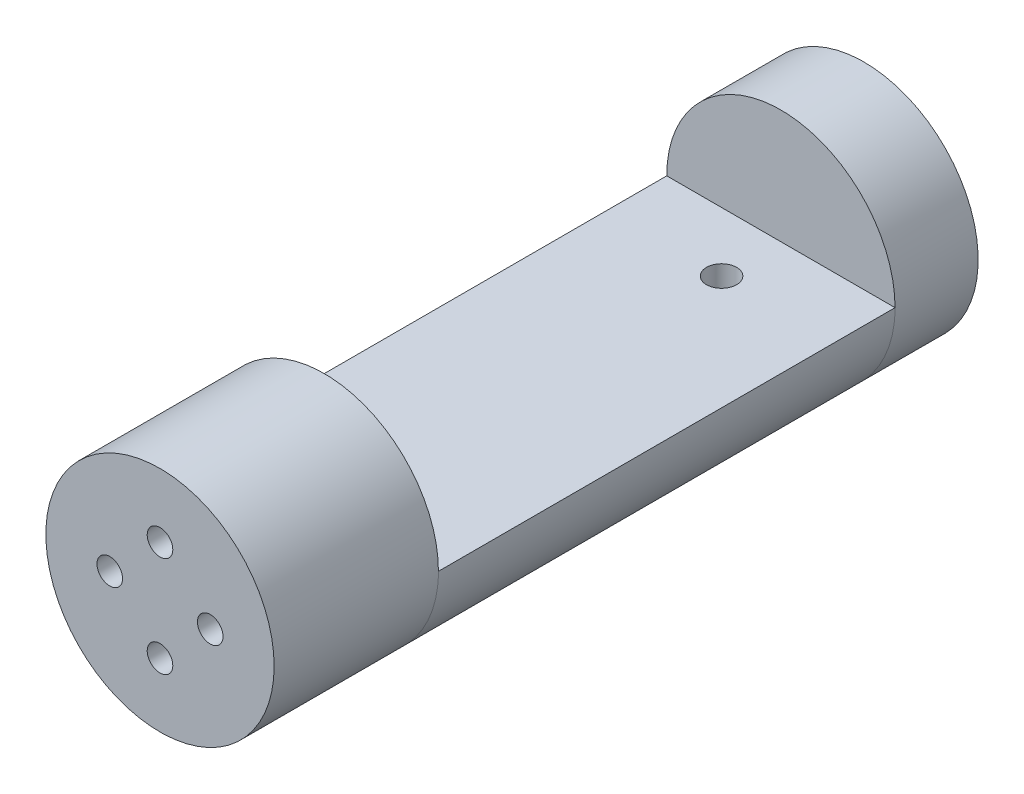
ISO-10303-21;
HEADER;
FILE_DESCRIPTION(('STEP AP214'),'2;1');
FILE_NAME('part.step','',(''),(''),'','','');
FILE_SCHEMA(('AUTOMOTIVE_DESIGN { 1 0 10303 214 1 1 1 1 }'));
ENDSEC;
DATA;
#1=APPLICATION_CONTEXT('core data for automotive mechanical design processes');
#2=APPLICATION_PROTOCOL_DEFINITION('international standard','automotive_design',2000,#1);
#3=PRODUCT_CONTEXT('',#1,'mechanical');
#4=PRODUCT('Part','Part','',(#3));
#5=PRODUCT_RELATED_PRODUCT_CATEGORY('part','',(#4));
#6=PRODUCT_DEFINITION_FORMATION('','',#4);
#7=PRODUCT_DEFINITION_CONTEXT('part definition',#1,'design');
#8=PRODUCT_DEFINITION('design','',#6,#7);
#9=PRODUCT_DEFINITION_SHAPE('','',#8);
#10=(LENGTH_UNIT() NAMED_UNIT(*) SI_UNIT(.MILLI.,.METRE.));
#11=(NAMED_UNIT(*) PLANE_ANGLE_UNIT() SI_UNIT($,.RADIAN.));
#12=(NAMED_UNIT(*) SI_UNIT($,.STERADIAN.) SOLID_ANGLE_UNIT());
#13=UNCERTAINTY_MEASURE_WITH_UNIT(LENGTH_MEASURE(1.E-05),#10,'distance_accuracy_value','');
#14=(GEOMETRIC_REPRESENTATION_CONTEXT(3) GLOBAL_UNCERTAINTY_ASSIGNED_CONTEXT((#13)) GLOBAL_UNIT_ASSIGNED_CONTEXT((#10,
#11,#12)) REPRESENTATION_CONTEXT('',''));
#15=CARTESIAN_POINT('',(0.,0.,0.));
#16=DIRECTION('',(0.,0.,1.));
#17=DIRECTION('',(1.,0.,0.));
#18=AXIS2_PLACEMENT_3D('',#15,#16,#17);
#19=CARTESIAN_POINT('',(0.,0.,17.99));
#20=DIRECTION('',(0.,0.,-1.));
#21=DIRECTION('',(-1.,0.,0.));
#22=AXIS2_PLACEMENT_3D('',#19,#20,#21);
#23=CYLINDRICAL_SURFACE('',#22,12.5);
#24=CARTESIAN_POINT('',(0.,0.,17.99));
#25=DIRECTION('',(0.,0.,1.));
#26=DIRECTION('',(1.,0.,0.));
#27=AXIS2_PLACEMENT_3D('',#24,#25,#26);
#28=CIRCLE('',#27,12.5);
#29=CARTESIAN_POINT('',(12.5,0.,17.99));
#30=VERTEX_POINT('',#29);
#31=EDGE_CURVE('E11',#30,#30,#28,.T.);
#32=ORIENTED_EDGE('',*,*,#31,.F.);
#33=EDGE_LOOP('',(#32));
#34=FACE_BOUND('',#33,.T.);
#35=CARTESIAN_POINT('',(0.,0.,0.));
#36=DIRECTION('',(0.,0.,1.));
#37=DIRECTION('',(1.,0.,0.));
#38=AXIS2_PLACEMENT_3D('',#35,#36,#37);
#39=CIRCLE('',#38,12.5);
#40=CARTESIAN_POINT('',(12.5,0.,0.));
#41=VERTEX_POINT('',#40);
#42=CARTESIAN_POINT('',(-12.5,0.,0.));
#43=VERTEX_POINT('',#42);
#44=EDGE_CURVE('E42',#41,#43,#39,.T.);
#45=ORIENTED_EDGE('',*,*,#44,.T.);
#46=CARTESIAN_POINT('',(0.,0.,0.));
#47=DIRECTION('',(0.,0.,1.));
#48=DIRECTION('',(1.,0.,0.));
#49=AXIS2_PLACEMENT_3D('',#46,#47,#48);
#50=ELLIPSE('',#49,12.5,12.5);
#51=EDGE_CURVE('E54',#43,#41,#50,.T.);
#52=ORIENTED_EDGE('',*,*,#51,.T.);
#53=EDGE_LOOP('',(#45,#52));
#54=FACE_BOUND('',#53,.T.);
#55=ADVANCED_FACE('F39',(#34,#54),#23,.T.);
#56=CARTESIAN_POINT('',(0.,0.,17.99));
#57=DIRECTION('',(0.,0.,1.));
#58=DIRECTION('',(1.,0.,0.));
#59=AXIS2_PLACEMENT_3D('',#56,#57,#58);
#60=PLANE('',#59);
#61=CARTESIAN_POINT('',(-5.5,0.,17.99));
#62=DIRECTION('',(0.,0.,1.));
#63=DIRECTION('',(1.,0.,0.));
#64=AXIS2_PLACEMENT_3D('',#61,#62,#63);
#65=CIRCLE('',#64,1.4);
#66=CARTESIAN_POINT('',(-4.1,0.,17.99));
#67=VERTEX_POINT('',#66);
#68=EDGE_CURVE('E158',#67,#67,#65,.T.);
#69=ORIENTED_EDGE('',*,*,#68,.F.);
#70=EDGE_LOOP('',(#69));
#71=FACE_BOUND('',#70,.T.);
#72=CARTESIAN_POINT('',(0.,5.5,17.99));
#73=DIRECTION('',(0.,0.,1.));
#74=DIRECTION('',(1.,0.,0.));
#75=AXIS2_PLACEMENT_3D('',#72,#73,#74);
#76=CIRCLE('',#75,1.4);
#77=CARTESIAN_POINT('',(1.4,5.5,17.99));
#78=VERTEX_POINT('',#77);
#79=EDGE_CURVE('E163',#78,#78,#76,.T.);
#80=ORIENTED_EDGE('',*,*,#79,.F.);
#81=EDGE_LOOP('',(#80));
#82=FACE_BOUND('',#81,.T.);
#83=CARTESIAN_POINT('',(5.5,0.,17.99));
#84=DIRECTION('',(0.,0.,1.));
#85=DIRECTION('',(1.,0.,0.));
#86=AXIS2_PLACEMENT_3D('',#83,#84,#85);
#87=CIRCLE('',#86,1.4);
#88=CARTESIAN_POINT('',(6.9,0.,17.99));
#89=VERTEX_POINT('',#88);
#90=EDGE_CURVE('E173',#89,#89,#87,.T.);
#91=ORIENTED_EDGE('',*,*,#90,.F.);
#92=EDGE_LOOP('',(#91));
#93=FACE_BOUND('',#92,.T.);
#94=CARTESIAN_POINT('',(0.,-5.5,17.99));
#95=DIRECTION('',(0.,0.,1.));
#96=DIRECTION('',(1.,0.,0.));
#97=AXIS2_PLACEMENT_3D('',#94,#95,#96);
#98=CIRCLE('',#97,1.4);
#99=CARTESIAN_POINT('',(1.4,-5.5,17.99));
#100=VERTEX_POINT('',#99);
#101=EDGE_CURVE('E181',#100,#100,#98,.T.);
#102=ORIENTED_EDGE('',*,*,#101,.F.);
#103=EDGE_LOOP('',(#102));
#104=FACE_BOUND('',#103,.T.);
#105=ORIENTED_EDGE('',*,*,#31,.T.);
#106=EDGE_LOOP('',(#105));
#107=FACE_BOUND('',#106,.T.);
#108=ADVANCED_FACE('F139',(#71,#82,#93,#104,#107),#60,.T.);
#109=CARTESIAN_POINT('',(0.,0.,0.));
#110=DIRECTION('',(0.,0.,1.));
#111=DIRECTION('',(1.,0.,0.));
#112=AXIS2_PLACEMENT_3D('',#109,#110,#111);
#113=PLANE('',#112);
#114=ORIENTED_EDGE('',*,*,#44,.F.);
#115=DIRECTION('',(-1.,0.,0.));
#116=VECTOR('',#115,1.);
#117=CARTESIAN_POINT('',(12.5,0.,0.));
#118=LINE('',#117,#116);
#119=EDGE_CURVE('E85',#41,#43,#118,.T.);
#120=ORIENTED_EDGE('',*,*,#119,.T.);
#121=EDGE_LOOP('',(#114,#120));
#122=FACE_BOUND('',#121,.T.);
#123=ADVANCED_FACE('F134',(#122),#113,.F.);
#124=CARTESIAN_POINT('',(0.,-5.5,9.99));
#125=DIRECTION('',(0.,0.,1.));
#126=DIRECTION('',(1.,0.,0.));
#127=AXIS2_PLACEMENT_3D('',#124,#125,#126);
#128=CYLINDRICAL_SURFACE('',#127,1.4);
#129=CARTESIAN_POINT('',(0.,-5.5,9.99));
#130=DIRECTION('',(0.,0.,1.));
#131=DIRECTION('',(1.,0.,0.));
#132=AXIS2_PLACEMENT_3D('',#129,#130,#131);
#133=CIRCLE('',#132,1.4);
#134=CARTESIAN_POINT('',(1.4,-5.5,9.99));
#135=VERTEX_POINT('',#134);
#136=EDGE_CURVE('E87',#135,#135,#133,.T.);
#137=ORIENTED_EDGE('',*,*,#136,.F.);
#138=EDGE_LOOP('',(#137));
#139=FACE_BOUND('',#138,.T.);
#140=ORIENTED_EDGE('',*,*,#101,.T.);
#141=EDGE_LOOP('',(#140));
#142=FACE_BOUND('',#141,.T.);
#143=ADVANCED_FACE('F131',(#139,#142),#128,.F.);
#144=CARTESIAN_POINT('',(0.,-5.5,9.99));
#145=DIRECTION('',(0.,0.,1.));
#146=DIRECTION('',(1.,0.,0.));
#147=AXIS2_PLACEMENT_3D('',#144,#145,#146);
#148=PLANE('',#147);
#149=ORIENTED_EDGE('',*,*,#136,.T.);
#150=EDGE_LOOP('',(#149));
#151=FACE_BOUND('',#150,.T.);
#152=ADVANCED_FACE('F126',(#151),#148,.T.);
#153=CARTESIAN_POINT('',(5.5,0.,9.99));
#154=DIRECTION('',(0.,0.,1.));
#155=DIRECTION('',(1.,0.,0.));
#156=AXIS2_PLACEMENT_3D('',#153,#154,#155);
#157=CYLINDRICAL_SURFACE('',#156,1.4);
#158=CARTESIAN_POINT('',(5.5,0.,9.99));
#159=DIRECTION('',(0.,0.,1.));
#160=DIRECTION('',(1.,0.,0.));
#161=AXIS2_PLACEMENT_3D('',#158,#159,#160);
#162=CIRCLE('',#161,1.4);
#163=CARTESIAN_POINT('',(6.9,0.,9.99));
#164=VERTEX_POINT('',#163);
#165=EDGE_CURVE('E177',#164,#164,#162,.T.);
#166=ORIENTED_EDGE('',*,*,#165,.F.);
#167=EDGE_LOOP('',(#166));
#168=FACE_BOUND('',#167,.T.);
#169=ORIENTED_EDGE('',*,*,#90,.T.);
#170=EDGE_LOOP('',(#169));
#171=FACE_BOUND('',#170,.T.);
#172=ADVANCED_FACE('F123',(#168,#171),#157,.F.);
#173=CARTESIAN_POINT('',(5.5,0.,9.99));
#174=DIRECTION('',(0.,0.,1.));
#175=DIRECTION('',(1.,0.,0.));
#176=AXIS2_PLACEMENT_3D('',#173,#174,#175);
#177=PLANE('',#176);
#178=ORIENTED_EDGE('',*,*,#165,.T.);
#179=EDGE_LOOP('',(#178));
#180=FACE_BOUND('',#179,.T.);
#181=ADVANCED_FACE('F118',(#180),#177,.T.);
#182=CARTESIAN_POINT('',(0.,5.5,9.99));
#183=DIRECTION('',(0.,0.,1.));
#184=DIRECTION('',(1.,0.,0.));
#185=AXIS2_PLACEMENT_3D('',#182,#183,#184);
#186=CYLINDRICAL_SURFACE('',#185,1.4);
#187=CARTESIAN_POINT('',(0.,5.5,9.99));
#188=DIRECTION('',(0.,0.,1.));
#189=DIRECTION('',(1.,0.,0.));
#190=AXIS2_PLACEMENT_3D('',#187,#188,#189);
#191=CIRCLE('',#190,1.4);
#192=CARTESIAN_POINT('',(1.4,5.5,9.99));
#193=VERTEX_POINT('',#192);
#194=EDGE_CURVE('E169',#193,#193,#191,.T.);
#195=ORIENTED_EDGE('',*,*,#194,.F.);
#196=EDGE_LOOP('',(#195));
#197=FACE_BOUND('',#196,.T.);
#198=ORIENTED_EDGE('',*,*,#79,.T.);
#199=EDGE_LOOP('',(#198));
#200=FACE_BOUND('',#199,.T.);
#201=ADVANCED_FACE('F115',(#197,#200),#186,.F.);
#202=CARTESIAN_POINT('',(0.,5.5,9.99));
#203=DIRECTION('',(0.,0.,1.));
#204=DIRECTION('',(1.,0.,0.));
#205=AXIS2_PLACEMENT_3D('',#202,#203,#204);
#206=PLANE('',#205);
#207=ORIENTED_EDGE('',*,*,#194,.T.);
#208=EDGE_LOOP('',(#207));
#209=FACE_BOUND('',#208,.T.);
#210=ADVANCED_FACE('F113',(#209),#206,.T.);
#211=CARTESIAN_POINT('',(-5.5,0.,9.99));
#212=DIRECTION('',(0.,0.,1.));
#213=DIRECTION('',(1.,0.,0.));
#214=AXIS2_PLACEMENT_3D('',#211,#212,#213);
#215=CYLINDRICAL_SURFACE('',#214,1.4);
#216=CARTESIAN_POINT('',(-5.5,0.,9.99));
#217=DIRECTION('',(0.,0.,1.));
#218=DIRECTION('',(1.,0.,0.));
#219=AXIS2_PLACEMENT_3D('',#216,#217,#218);
#220=CIRCLE('',#219,1.4);
#221=CARTESIAN_POINT('',(-4.1,0.,9.99));
#222=VERTEX_POINT('',#221);
#223=EDGE_CURVE('E155',#222,#222,#220,.T.);
#224=ORIENTED_EDGE('',*,*,#223,.F.);
#225=EDGE_LOOP('',(#224));
#226=FACE_BOUND('',#225,.T.);
#227=ORIENTED_EDGE('',*,*,#68,.T.);
#228=EDGE_LOOP('',(#227));
#229=FACE_BOUND('',#228,.T.);
#230=ADVANCED_FACE('F109',(#226,#229),#215,.F.);
#231=CARTESIAN_POINT('',(-5.5,0.,9.99));
#232=DIRECTION('',(0.,0.,1.));
#233=DIRECTION('',(1.,0.,0.));
#234=AXIS2_PLACEMENT_3D('',#231,#232,#233);
#235=PLANE('',#234);
#236=ORIENTED_EDGE('',*,*,#223,.T.);
#237=EDGE_LOOP('',(#236));
#238=FACE_BOUND('',#237,.T.);
#239=ADVANCED_FACE('F105',(#238),#235,.T.);
#240=CARTESIAN_POINT('',(12.5,0.,-50.));
#241=DIRECTION('',(0.,1.,0.));
#242=DIRECTION('',(0.,0.,1.));
#243=AXIS2_PLACEMENT_3D('',#240,#241,#242);
#244=PLANE('',#243);
#245=CARTESIAN_POINT('',(0.,0.,-43.5));
#246=DIRECTION('',(0.,1.,0.));
#247=DIRECTION('',(0.,0.,1.));
#248=AXIS2_PLACEMENT_3D('',#245,#246,#247);
#249=CIRCLE('',#248,1.65);
#250=CARTESIAN_POINT('',(0.,0.,-41.85));
#251=VERTEX_POINT('',#250);
#252=EDGE_CURVE('E216',#251,#251,#249,.T.);
#253=ORIENTED_EDGE('',*,*,#252,.F.);
#254=EDGE_LOOP('',(#253));
#255=FACE_BOUND('',#254,.T.);
#256=CARTESIAN_POINT('',(0.,0.,-6.50000000000001));
#257=DIRECTION('',(0.,1.,0.));
#258=DIRECTION('',(0.,0.,1.));
#259=AXIS2_PLACEMENT_3D('',#256,#257,#258);
#260=CIRCLE('',#259,1.65);
#261=CARTESIAN_POINT('',(0.,0.,-4.85));
#262=VERTEX_POINT('',#261);
#263=EDGE_CURVE('E208',#262,#262,#260,.T.);
#264=ORIENTED_EDGE('',*,*,#263,.F.);
#265=EDGE_LOOP('',(#264));
#266=FACE_BOUND('',#265,.T.);
#267=ORIENTED_EDGE('',*,*,#119,.F.);
#268=DIRECTION('',(0.,0.,1.));
#269=VECTOR('',#268,1.);
#270=CARTESIAN_POINT('',(12.5,0.,-50.));
#271=LINE('',#270,#269);
#272=CARTESIAN_POINT('',(12.5,0.,-50.));
#273=VERTEX_POINT('',#272);
#274=EDGE_CURVE('E82',#273,#41,#271,.T.);
#275=ORIENTED_EDGE('',*,*,#274,.F.);
#276=DIRECTION('',(-1.,0.,0.));
#277=VECTOR('',#276,1.);
#278=CARTESIAN_POINT('',(12.5,0.,-50.));
#279=LINE('',#278,#277);
#280=CARTESIAN_POINT('',(-12.5,0.,-50.));
#281=VERTEX_POINT('',#280);
#282=EDGE_CURVE('E67',#273,#281,#279,.T.);
#283=ORIENTED_EDGE('',*,*,#282,.T.);
#284=DIRECTION('',(0.,0.,1.));
#285=VECTOR('',#284,1.);
#286=CARTESIAN_POINT('',(-12.5,0.,-50.));
#287=LINE('',#286,#285);
#288=EDGE_CURVE('E88',#281,#43,#287,.T.);
#289=ORIENTED_EDGE('',*,*,#288,.T.);
#290=EDGE_LOOP('',(#267,#275,#283,#289));
#291=FACE_BOUND('',#290,.T.);
#292=ADVANCED_FACE('F83',(#255,#266,#291),#244,.T.);
#293=CARTESIAN_POINT('',(0.,0.,-50.));
#294=DIRECTION('',(0.,0.,1.));
#295=DIRECTION('',(1.,0.,0.));
#296=AXIS2_PLACEMENT_3D('',#293,#294,#295);
#297=ELLIPSE('',#296,12.5,12.5);
#298=DIRECTION('',(0.,0.,1.));
#299=VECTOR('',#298,1.);
#300=SURFACE_OF_LINEAR_EXTRUSION('',#297,#299);
#301=ORIENTED_EDGE('',*,*,#51,.F.);
#302=ORIENTED_EDGE('',*,*,#288,.F.);
#303=EDGE_CURVE('E72',#281,#273,#297,.T.);
#304=ORIENTED_EDGE('',*,*,#303,.T.);
#305=ORIENTED_EDGE('',*,*,#274,.T.);
#306=EDGE_LOOP('',(#301,#302,#304,#305));
#307=FACE_BOUND('',#306,.T.);
#308=ADVANCED_FACE('F90',(#307),#300,.T.);
#309=CARTESIAN_POINT('',(0.,0.,-59.1));
#310=DIRECTION('',(0.,0.,1.));
#311=DIRECTION('',(1.,0.,0.));
#312=AXIS2_PLACEMENT_3D('',#309,#310,#311);
#313=CYLINDRICAL_SURFACE('',#312,12.5);
#314=CARTESIAN_POINT('',(0.,0.,-59.1));
#315=DIRECTION('',(0.,0.,-1.));
#316=DIRECTION('',(-1.,0.,0.));
#317=AXIS2_PLACEMENT_3D('',#314,#315,#316);
#318=CIRCLE('',#317,12.5);
#319=CARTESIAN_POINT('',(-12.5,0.,-59.1));
#320=VERTEX_POINT('',#319);
#321=EDGE_CURVE('E78',#320,#320,#318,.T.);
#322=ORIENTED_EDGE('',*,*,#321,.F.);
#323=EDGE_LOOP('',(#322));
#324=FACE_BOUND('',#323,.T.);
#325=CARTESIAN_POINT('',(0.,0.,-50.));
#326=DIRECTION('',(0.,0.,-1.));
#327=DIRECTION('',(-1.,0.,0.));
#328=AXIS2_PLACEMENT_3D('',#325,#326,#327);
#329=CIRCLE('',#328,12.5);
#330=EDGE_CURVE('E62',#281,#273,#329,.T.);
#331=ORIENTED_EDGE('',*,*,#330,.T.);
#332=ORIENTED_EDGE('',*,*,#303,.F.);
#333=EDGE_LOOP('',(#331,#332));
#334=FACE_BOUND('',#333,.T.);
#335=ADVANCED_FACE('F75',(#324,#334),#313,.T.);
#336=CARTESIAN_POINT('',(0.,0.,-59.1));
#337=DIRECTION('',(0.,0.,-1.));
#338=DIRECTION('',(-1.,0.,0.));
#339=AXIS2_PLACEMENT_3D('',#336,#337,#338);
#340=PLANE('',#339);
#341=ORIENTED_EDGE('',*,*,#321,.T.);
#342=EDGE_LOOP('',(#341));
#343=FACE_BOUND('',#342,.T.);
#344=ADVANCED_FACE('F245',(#343),#340,.T.);
#345=CARTESIAN_POINT('',(0.,0.,-50.));
#346=DIRECTION('',(0.,0.,-1.));
#347=DIRECTION('',(-1.,0.,0.));
#348=AXIS2_PLACEMENT_3D('',#345,#346,#347);
#349=PLANE('',#348);
#350=ORIENTED_EDGE('',*,*,#282,.F.);
#351=ORIENTED_EDGE('',*,*,#330,.F.);
#352=EDGE_LOOP('',(#350,#351));
#353=FACE_BOUND('',#352,.T.);
#354=ADVANCED_FACE('F68',(#353),#349,.F.);
#355=CARTESIAN_POINT('',(0.,-10.,-6.50000000000001));
#356=DIRECTION('',(0.,1.,0.));
#357=DIRECTION('',(0.,0.,1.));
#358=AXIS2_PLACEMENT_3D('',#355,#356,#357);
#359=CYLINDRICAL_SURFACE('',#358,1.65);
#360=CARTESIAN_POINT('',(0.,-10.,-6.50000000000001));
#361=DIRECTION('',(0.,1.,0.));
#362=DIRECTION('',(0.,0.,1.));
#363=AXIS2_PLACEMENT_3D('',#360,#361,#362);
#364=CIRCLE('',#363,1.65);
#365=CARTESIAN_POINT('',(0.,-10.,-4.85));
#366=VERTEX_POINT('',#365);
#367=EDGE_CURVE('E212',#366,#366,#364,.T.);
#368=ORIENTED_EDGE('',*,*,#367,.F.);
#369=EDGE_LOOP('',(#368));
#370=FACE_BOUND('',#369,.T.);
#371=ORIENTED_EDGE('',*,*,#263,.T.);
#372=EDGE_LOOP('',(#371));
#373=FACE_BOUND('',#372,.T.);
#374=ADVANCED_FACE('F235',(#370,#373),#359,.F.);
#375=CARTESIAN_POINT('',(0.,-10.,-6.50000000000001));
#376=DIRECTION('',(0.,1.,0.));
#377=DIRECTION('',(0.,0.,1.));
#378=AXIS2_PLACEMENT_3D('',#375,#376,#377);
#379=PLANE('',#378);
#380=ORIENTED_EDGE('',*,*,#367,.T.);
#381=EDGE_LOOP('',(#380));
#382=FACE_BOUND('',#381,.T.);
#383=ADVANCED_FACE('F229',(#382),#379,.T.);
#384=CARTESIAN_POINT('',(0.,-10.,-43.5));
#385=DIRECTION('',(0.,1.,0.));
#386=DIRECTION('',(0.,0.,1.));
#387=AXIS2_PLACEMENT_3D('',#384,#385,#386);
#388=CYLINDRICAL_SURFACE('',#387,1.65);
#389=CARTESIAN_POINT('',(0.,-10.,-43.5));
#390=DIRECTION('',(0.,1.,0.));
#391=DIRECTION('',(0.,0.,1.));
#392=AXIS2_PLACEMENT_3D('',#389,#390,#391);
#393=CIRCLE('',#392,1.65);
#394=CARTESIAN_POINT('',(0.,-10.,-41.85));
#395=VERTEX_POINT('',#394);
#396=EDGE_CURVE('E79',#395,#395,#393,.T.);
#397=ORIENTED_EDGE('',*,*,#396,.F.);
#398=EDGE_LOOP('',(#397));
#399=FACE_BOUND('',#398,.T.);
#400=ORIENTED_EDGE('',*,*,#252,.T.);
#401=EDGE_LOOP('',(#400));
#402=FACE_BOUND('',#401,.T.);
#403=ADVANCED_FACE('F226',(#399,#402),#388,.F.);
#404=CARTESIAN_POINT('',(0.,-10.,-43.5));
#405=DIRECTION('',(0.,1.,0.));
#406=DIRECTION('',(0.,0.,1.));
#407=AXIS2_PLACEMENT_3D('',#404,#405,#406);
#408=PLANE('',#407);
#409=ORIENTED_EDGE('',*,*,#396,.T.);
#410=EDGE_LOOP('',(#409));
#411=FACE_BOUND('',#410,.T.);
#412=ADVANCED_FACE('F224',(#411),#408,.T.);
#413=CLOSED_SHELL('',(#55,#108,#123,#143,#152,#172,#181,#201,#210,#230,#239,#292,#308,#335,#344,
#354,#374,#383,#403,#412));
#414=MANIFOLD_SOLID_BREP('B2',#413);
#415=ADVANCED_BREP_SHAPE_REPRESENTATION('',(#18,#414),#14);
#416=SHAPE_DEFINITION_REPRESENTATION(#9,#415);
ENDSEC;
END-ISO-10303-21;
